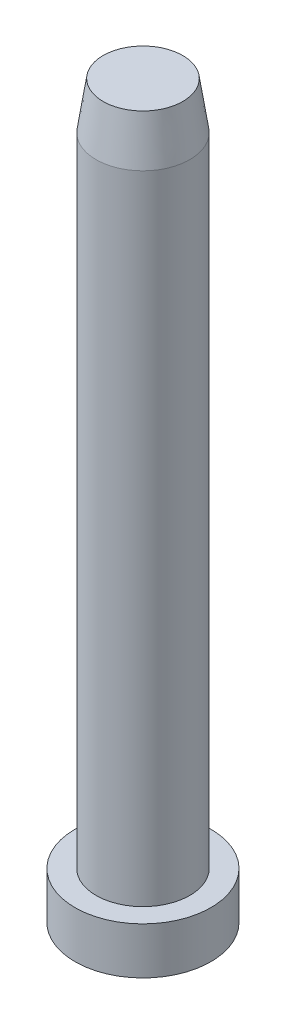
ISO-10303-21;
HEADER;
FILE_DESCRIPTION(('STEP AP214'),'2;1');
FILE_NAME('part.step','',(''),(''),'','','');
FILE_SCHEMA(('AUTOMOTIVE_DESIGN { 1 0 10303 214 1 1 1 1 }'));
ENDSEC;
DATA;
#1=APPLICATION_CONTEXT('core data for automotive mechanical design processes');
#2=APPLICATION_PROTOCOL_DEFINITION('international standard','automotive_design',2000,#1);
#3=PRODUCT_CONTEXT('',#1,'mechanical');
#4=PRODUCT('Part','Part','',(#3));
#5=PRODUCT_RELATED_PRODUCT_CATEGORY('part','',(#4));
#6=PRODUCT_DEFINITION_FORMATION('','',#4);
#7=PRODUCT_DEFINITION_CONTEXT('part definition',#1,'design');
#8=PRODUCT_DEFINITION('design','',#6,#7);
#9=PRODUCT_DEFINITION_SHAPE('','',#8);
#10=(LENGTH_UNIT() NAMED_UNIT(*) SI_UNIT(.MILLI.,.METRE.));
#11=(NAMED_UNIT(*) PLANE_ANGLE_UNIT() SI_UNIT($,.RADIAN.));
#12=(NAMED_UNIT(*) SI_UNIT($,.STERADIAN.) SOLID_ANGLE_UNIT());
#13=UNCERTAINTY_MEASURE_WITH_UNIT(LENGTH_MEASURE(1.E-05),#10,'distance_accuracy_value','');
#14=(GEOMETRIC_REPRESENTATION_CONTEXT(3) GLOBAL_UNCERTAINTY_ASSIGNED_CONTEXT((#13)) GLOBAL_UNIT_ASSIGNED_CONTEXT((#10,
#11,#12)) REPRESENTATION_CONTEXT('',''));
#15=CARTESIAN_POINT('',(0.,0.,0.));
#16=DIRECTION('',(0.,0.,1.));
#17=DIRECTION('',(1.,0.,0.));
#18=AXIS2_PLACEMENT_3D('',#15,#16,#17);
#19=CARTESIAN_POINT('',(0.,0.,0.));
#20=DIRECTION('',(0.,1.,0.));
#21=DIRECTION('',(-1.,0.,0.));
#22=AXIS2_PLACEMENT_3D('',#19,#20,#21);
#23=PLANE('',#22);
#24=CARTESIAN_POINT('',(0.,0.,0.));
#25=DIRECTION('',(0.,1.,0.));
#26=DIRECTION('',(-1.,0.,0.));
#27=AXIS2_PLACEMENT_3D('',#24,#25,#26);
#28=CIRCLE('',#27,7.25);
#29=CARTESIAN_POINT('',(-7.25,0.,0.));
#30=VERTEX_POINT('',#29);
#31=EDGE_CURVE('E10',#30,#30,#28,.T.);
#32=ORIENTED_EDGE('',*,*,#31,.F.);
#33=EDGE_LOOP('',(#32));
#34=FACE_BOUND('',#33,.T.);
#35=ADVANCED_FACE('F34',(#34),#23,.F.);
#36=CARTESIAN_POINT('',(0.,78.,0.));
#37=DIRECTION('',(0.,1.,0.));
#38=DIRECTION('',(-1.,0.,0.));
#39=AXIS2_PLACEMENT_3D('',#36,#37,#38);
#40=CYLINDRICAL_SURFACE('',#39,7.25);
#41=CARTESIAN_POINT('',(0.,5.,0.));
#42=DIRECTION('',(0.,1.,0.));
#43=DIRECTION('',(-1.,0.,0.));
#44=AXIS2_PLACEMENT_3D('',#41,#42,#43);
#45=CIRCLE('',#44,7.25);
#46=CARTESIAN_POINT('',(-7.25,5.,0.));
#47=VERTEX_POINT('',#46);
#48=EDGE_CURVE('E40',#47,#47,#45,.T.);
#49=ORIENTED_EDGE('',*,*,#48,.F.);
#50=EDGE_LOOP('',(#49));
#51=FACE_BOUND('',#50,.T.);
#52=ORIENTED_EDGE('',*,*,#31,.T.);
#53=EDGE_LOOP('',(#52));
#54=FACE_BOUND('',#53,.T.);
#55=ADVANCED_FACE('F73',(#51,#54),#40,.T.);
#56=CARTESIAN_POINT('',(7.25,5.,0.));
#57=DIRECTION('',(0.,-1.,0.));
#58=DIRECTION('',(1.,0.,0.));
#59=AXIS2_PLACEMENT_3D('',#56,#57,#58);
#60=PLANE('',#59);
#61=CARTESIAN_POINT('',(0.,5.,0.));
#62=DIRECTION('',(0.,1.,0.));
#63=DIRECTION('',(-1.,0.,0.));
#64=AXIS2_PLACEMENT_3D('',#61,#62,#63);
#65=CIRCLE('',#64,5.);
#66=CARTESIAN_POINT('',(-5.,5.,0.));
#67=VERTEX_POINT('',#66);
#68=EDGE_CURVE('E44',#67,#67,#65,.T.);
#69=ORIENTED_EDGE('',*,*,#68,.F.);
#70=EDGE_LOOP('',(#69));
#71=FACE_BOUND('',#70,.T.);
#72=ORIENTED_EDGE('',*,*,#48,.T.);
#73=EDGE_LOOP('',(#72));
#74=FACE_BOUND('',#73,.T.);
#75=ADVANCED_FACE('F68',(#71,#74),#60,.F.);
#76=CARTESIAN_POINT('',(0.,78.,0.));
#77=DIRECTION('',(0.,1.,0.));
#78=DIRECTION('',(-1.,0.,0.));
#79=AXIS2_PLACEMENT_3D('',#76,#77,#78);
#80=CYLINDRICAL_SURFACE('',#79,5.);
#81=CARTESIAN_POINT('',(0.,73.,0.));
#82=DIRECTION('',(0.,1.,0.));
#83=DIRECTION('',(-1.,0.,0.));
#84=AXIS2_PLACEMENT_3D('',#81,#82,#83);
#85=CIRCLE('',#84,5.);
#86=CARTESIAN_POINT('',(-5.00000000000001,73.,0.));
#87=VERTEX_POINT('',#86);
#88=EDGE_CURVE('E48',#87,#87,#85,.T.);
#89=ORIENTED_EDGE('',*,*,#88,.F.);
#90=EDGE_LOOP('',(#89));
#91=FACE_BOUND('',#90,.T.);
#92=ORIENTED_EDGE('',*,*,#68,.T.);
#93=EDGE_LOOP('',(#92));
#94=FACE_BOUND('',#93,.T.);
#95=ADVANCED_FACE('F62',(#91,#94),#80,.T.);
#96=CARTESIAN_POINT('',(0.,73.,0.));
#97=DIRECTION('',(0.,-1.,0.));
#98=DIRECTION('',(1.,0.,0.));
#99=AXIS2_PLACEMENT_3D('',#96,#97,#98);
#100=CONICAL_SURFACE('',#99,5.,0.148889947609497);
#101=CARTESIAN_POINT('',(0.,78.,0.));
#102=DIRECTION('',(0.,1.,0.));
#103=DIRECTION('',(-1.,0.,0.));
#104=AXIS2_PLACEMENT_3D('',#101,#102,#103);
#105=CIRCLE('',#104,4.25);
#106=CARTESIAN_POINT('',(-4.25000000000001,78.,0.));
#107=VERTEX_POINT('',#106);
#108=EDGE_CURVE('E53',#107,#107,#105,.T.);
#109=ORIENTED_EDGE('',*,*,#108,.F.);
#110=EDGE_LOOP('',(#109));
#111=FACE_BOUND('',#110,.T.);
#112=ORIENTED_EDGE('',*,*,#88,.T.);
#113=EDGE_LOOP('',(#112));
#114=FACE_BOUND('',#113,.T.);
#115=ADVANCED_FACE('F59',(#111,#114),#100,.T.);
#116=CARTESIAN_POINT('',(4.24999999999999,78.,0.));
#117=DIRECTION('',(0.,-1.,0.));
#118=DIRECTION('',(1.,0.,0.));
#119=AXIS2_PLACEMENT_3D('',#116,#117,#118);
#120=PLANE('',#119);
#121=ORIENTED_EDGE('',*,*,#108,.T.);
#122=EDGE_LOOP('',(#121));
#123=FACE_BOUND('',#122,.T.);
#124=ADVANCED_FACE('F57',(#123),#120,.F.);
#125=CLOSED_SHELL('',(#35,#55,#75,#95,#115,#124));
#126=MANIFOLD_SOLID_BREP('B2',#125);
#127=ADVANCED_BREP_SHAPE_REPRESENTATION('',(#18,#126),#14);
#128=SHAPE_DEFINITION_REPRESENTATION(#9,#127);
ENDSEC;
END-ISO-10303-21;
